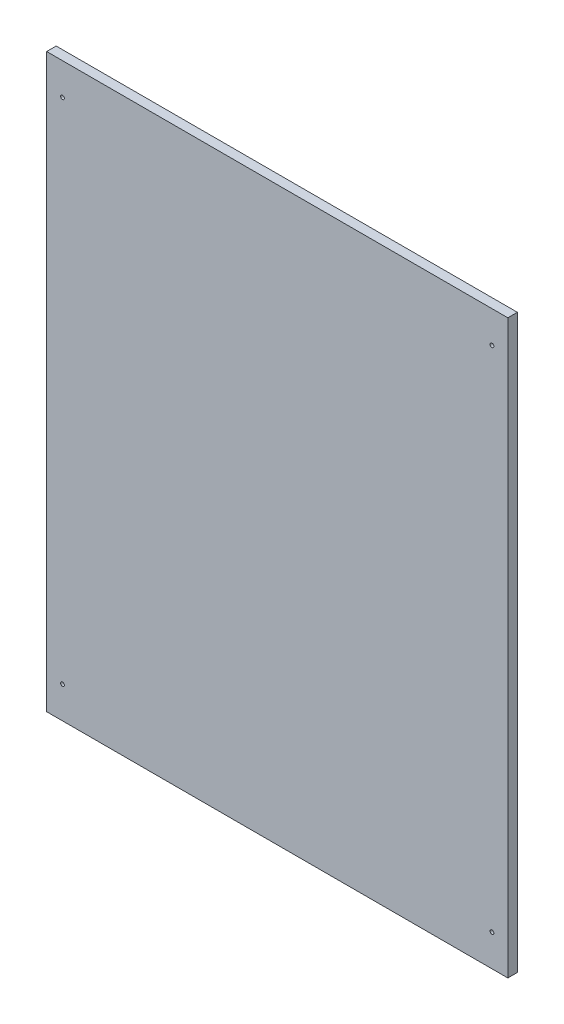
ISO-10303-21;
HEADER;
FILE_DESCRIPTION(('STEP AP214'),'2;1');
FILE_NAME('part.step','',(''),(''),'','','');
FILE_SCHEMA(('AUTOMOTIVE_DESIGN { 1 0 10303 214 1 1 1 1 }'));
ENDSEC;
DATA;
#1=APPLICATION_CONTEXT('core data for automotive mechanical design processes');
#2=APPLICATION_PROTOCOL_DEFINITION('international standard','automotive_design',2000,#1);
#3=PRODUCT_CONTEXT('',#1,'mechanical');
#4=PRODUCT('Part','Part','',(#3));
#5=PRODUCT_RELATED_PRODUCT_CATEGORY('part','',(#4));
#6=PRODUCT_DEFINITION_FORMATION('','',#4);
#7=PRODUCT_DEFINITION_CONTEXT('part definition',#1,'design');
#8=PRODUCT_DEFINITION('design','',#6,#7);
#9=PRODUCT_DEFINITION_SHAPE('','',#8);
#10=(LENGTH_UNIT() NAMED_UNIT(*) SI_UNIT(.MILLI.,.METRE.));
#11=(NAMED_UNIT(*) PLANE_ANGLE_UNIT() SI_UNIT($,.RADIAN.));
#12=(NAMED_UNIT(*) SI_UNIT($,.STERADIAN.) SOLID_ANGLE_UNIT());
#13=UNCERTAINTY_MEASURE_WITH_UNIT(LENGTH_MEASURE(1.E-05),#10,'distance_accuracy_value','');
#14=(GEOMETRIC_REPRESENTATION_CONTEXT(3) GLOBAL_UNCERTAINTY_ASSIGNED_CONTEXT((#13)) GLOBAL_UNIT_ASSIGNED_CONTEXT((#10,
#11,#12)) REPRESENTATION_CONTEXT('',''));
#15=CARTESIAN_POINT('',(0.,0.,0.));
#16=DIRECTION('',(0.,0.,1.));
#17=DIRECTION('',(1.,0.,0.));
#18=AXIS2_PLACEMENT_3D('',#15,#16,#17);
#19=CARTESIAN_POINT('',(-10.,0.,15.));
#20=DIRECTION('',(-1.,0.,0.));
#21=DIRECTION('',(0.,0.,1.));
#22=AXIS2_PLACEMENT_3D('',#19,#20,#21);
#23=PLANE('',#22);
#24=DIRECTION('',(0.,1.,0.));
#25=VECTOR('',#24,1.);
#26=CARTESIAN_POINT('',(-10.,0.,0.));
#27=LINE('',#26,#25);
#28=CARTESIAN_POINT('',(-10.,-874.999999999979,0.));
#29=VERTEX_POINT('',#28);
#30=CARTESIAN_POINT('',(-10.,24.9999999999994,0.));
#31=VERTEX_POINT('',#30);
#32=EDGE_CURVE('E118',#29,#31,#27,.T.);
#33=ORIENTED_EDGE('',*,*,#32,.F.);
#34=DIRECTION('',(0.,0.,-1.));
#35=VECTOR('',#34,1.);
#36=CARTESIAN_POINT('',(-10.,-874.999999999979,15.));
#37=LINE('',#36,#35);
#38=CARTESIAN_POINT('',(-10.,-874.999999999979,15.));
#39=VERTEX_POINT('',#38);
#40=EDGE_CURVE('E11',#39,#29,#37,.T.);
#41=ORIENTED_EDGE('',*,*,#40,.F.);
#42=DIRECTION('',(0.,1.,0.));
#43=VECTOR('',#42,1.);
#44=CARTESIAN_POINT('',(-10.,0.,15.));
#45=LINE('',#44,#43);
#46=CARTESIAN_POINT('',(-10.,24.9999999999994,15.));
#47=VERTEX_POINT('',#46);
#48=EDGE_CURVE('E99',#39,#47,#45,.T.);
#49=ORIENTED_EDGE('',*,*,#48,.T.);
#50=DIRECTION('',(0.,0.,-1.));
#51=VECTOR('',#50,1.);
#52=CARTESIAN_POINT('',(-10.,24.9999999999994,15.));
#53=LINE('',#52,#51);
#54=EDGE_CURVE('E80',#47,#31,#53,.T.);
#55=ORIENTED_EDGE('',*,*,#54,.T.);
#56=EDGE_LOOP('',(#33,#41,#49,#55));
#57=FACE_BOUND('',#56,.T.);
#58=ADVANCED_FACE('F41',(#57),#23,.T.);
#59=CARTESIAN_POINT('',(1.33807871425199E-13,-874.999999999979,15.));
#60=DIRECTION('',(0.,-1.,0.));
#61=DIRECTION('',(1.,0.,0.));
#62=AXIS2_PLACEMENT_3D('',#59,#60,#61);
#63=PLANE('',#62);
#64=DIRECTION('',(-1.,0.,0.));
#65=VECTOR('',#64,1.);
#66=CARTESIAN_POINT('',(1.33807871425199E-13,-874.999999999979,0.));
#67=LINE('',#66,#65);
#68=CARTESIAN_POINT('',(716.00000000003,-874.999999999978,0.));
#69=VERTEX_POINT('',#68);
#70=EDGE_CURVE('E91',#69,#29,#67,.T.);
#71=ORIENTED_EDGE('',*,*,#70,.F.);
#72=DIRECTION('',(0.,0.,-1.));
#73=VECTOR('',#72,1.);
#74=CARTESIAN_POINT('',(716.00000000003,-874.999999999978,15.));
#75=LINE('',#74,#73);
#76=CARTESIAN_POINT('',(716.00000000003,-874.999999999978,15.));
#77=VERTEX_POINT('',#76);
#78=EDGE_CURVE('E50',#77,#69,#75,.T.);
#79=ORIENTED_EDGE('',*,*,#78,.F.);
#80=DIRECTION('',(-1.,0.,0.));
#81=VECTOR('',#80,1.);
#82=CARTESIAN_POINT('',(1.33807871425199E-13,-874.999999999979,15.));
#83=LINE('',#82,#81);
#84=EDGE_CURVE('E89',#77,#39,#83,.T.);
#85=ORIENTED_EDGE('',*,*,#84,.T.);
#86=ORIENTED_EDGE('',*,*,#40,.T.);
#87=EDGE_LOOP('',(#71,#79,#85,#86));
#88=FACE_BOUND('',#87,.T.);
#89=ADVANCED_FACE('F88',(#88),#63,.T.);
#90=CARTESIAN_POINT('',(716.00000000003,0.,15.));
#91=DIRECTION('',(1.,0.,0.));
#92=DIRECTION('',(0.,0.,-1.));
#93=AXIS2_PLACEMENT_3D('',#90,#91,#92);
#94=PLANE('',#93);
#95=DIRECTION('',(0.,-1.,0.));
#96=VECTOR('',#95,1.);
#97=CARTESIAN_POINT('',(716.00000000003,0.,0.));
#98=LINE('',#97,#96);
#99=CARTESIAN_POINT('',(716.00000000003,24.9999999999994,0.));
#100=VERTEX_POINT('',#99);
#101=EDGE_CURVE('E122',#100,#69,#98,.T.);
#102=ORIENTED_EDGE('',*,*,#101,.F.);
#103=DIRECTION('',(0.,0.,-1.));
#104=VECTOR('',#103,1.);
#105=CARTESIAN_POINT('',(716.00000000003,24.9999999999994,15.));
#106=LINE('',#105,#104);
#107=CARTESIAN_POINT('',(716.00000000003,24.9999999999994,15.));
#108=VERTEX_POINT('',#107);
#109=EDGE_CURVE('E73',#108,#100,#106,.T.);
#110=ORIENTED_EDGE('',*,*,#109,.F.);
#111=DIRECTION('',(0.,-1.,0.));
#112=VECTOR('',#111,1.);
#113=CARTESIAN_POINT('',(716.00000000003,0.,15.));
#114=LINE('',#113,#112);
#115=EDGE_CURVE('E98',#108,#77,#114,.T.);
#116=ORIENTED_EDGE('',*,*,#115,.T.);
#117=ORIENTED_EDGE('',*,*,#78,.T.);
#118=EDGE_LOOP('',(#102,#110,#116,#117));
#119=FACE_BOUND('',#118,.T.);
#120=ADVANCED_FACE('F101',(#119),#94,.T.);
#121=CARTESIAN_POINT('',(691.00000000003,-824.999999999959,15.));
#122=DIRECTION('',(0.,0.,-1.));
#123=DIRECTION('',(-1.,0.,0.));
#124=AXIS2_PLACEMENT_3D('',#121,#122,#123);
#125=CYLINDRICAL_SURFACE('',#124,3.00000000000005);
#126=CARTESIAN_POINT('',(691.00000000003,-824.999999999959,15.));
#127=DIRECTION('',(0.,0.,1.));
#128=DIRECTION('',(1.,0.,0.));
#129=AXIS2_PLACEMENT_3D('',#126,#127,#128);
#130=CIRCLE('',#129,3.00000000000005);
#131=CARTESIAN_POINT('',(694.00000000003,-824.999999999959,15.));
#132=VERTEX_POINT('',#131);
#133=EDGE_CURVE('E103',#132,#132,#130,.T.);
#134=ORIENTED_EDGE('',*,*,#133,.T.);
#135=EDGE_LOOP('',(#134));
#136=FACE_BOUND('',#135,.T.);
#137=CARTESIAN_POINT('',(691.00000000003,-824.999999999959,0.));
#138=DIRECTION('',(0.,0.,1.));
#139=DIRECTION('',(1.,0.,0.));
#140=AXIS2_PLACEMENT_3D('',#137,#138,#139);
#141=CIRCLE('',#140,3.00000000000005);
#142=CARTESIAN_POINT('',(694.00000000003,-824.999999999959,0.));
#143=VERTEX_POINT('',#142);
#144=EDGE_CURVE('E126',#143,#143,#141,.T.);
#145=ORIENTED_EDGE('',*,*,#144,.F.);
#146=EDGE_LOOP('',(#145));
#147=FACE_BOUND('',#146,.T.);
#148=ADVANCED_FACE('F160',(#136,#147),#125,.F.);
#149=CARTESIAN_POINT('',(0.,24.9999999999994,15.));
#150=DIRECTION('',(0.,-1.,0.));
#151=DIRECTION('',(0.,0.,-1.));
#152=AXIS2_PLACEMENT_3D('',#149,#150,#151);
#153=PLANE('',#152);
#154=DIRECTION('',(-1.,0.,0.));
#155=VECTOR('',#154,1.);
#156=CARTESIAN_POINT('',(0.,24.9999999999994,0.));
#157=LINE('',#156,#155);
#158=EDGE_CURVE('E124',#100,#31,#157,.T.);
#159=ORIENTED_EDGE('',*,*,#158,.T.);
#160=ORIENTED_EDGE('',*,*,#54,.F.);
#161=DIRECTION('',(-1.,0.,0.));
#162=VECTOR('',#161,1.);
#163=CARTESIAN_POINT('',(0.,24.9999999999994,15.));
#164=LINE('',#163,#162);
#165=EDGE_CURVE('E58',#108,#47,#164,.T.);
#166=ORIENTED_EDGE('',*,*,#165,.F.);
#167=ORIENTED_EDGE('',*,*,#109,.T.);
#168=EDGE_LOOP('',(#159,#160,#166,#167));
#169=FACE_BOUND('',#168,.T.);
#170=ADVANCED_FACE('F152',(#169),#153,.F.);
#171=CARTESIAN_POINT('',(15.,-25.0000000000006,15.));
#172=DIRECTION('',(0.,0.,-1.));
#173=DIRECTION('',(-1.,0.,0.));
#174=AXIS2_PLACEMENT_3D('',#171,#172,#173);
#175=CYLINDRICAL_SURFACE('',#174,3.);
#176=CARTESIAN_POINT('',(15.,-25.0000000000006,15.));
#177=DIRECTION('',(0.,0.,1.));
#178=DIRECTION('',(1.,0.,0.));
#179=AXIS2_PLACEMENT_3D('',#176,#177,#178);
#180=CIRCLE('',#179,3.);
#181=CARTESIAN_POINT('',(18.,-25.0000000000006,15.));
#182=VERTEX_POINT('',#181);
#183=EDGE_CURVE('E137',#182,#182,#180,.T.);
#184=ORIENTED_EDGE('',*,*,#183,.T.);
#185=EDGE_LOOP('',(#184));
#186=FACE_BOUND('',#185,.T.);
#187=CARTESIAN_POINT('',(15.,-25.0000000000006,0.));
#188=DIRECTION('',(0.,0.,1.));
#189=DIRECTION('',(1.,0.,0.));
#190=AXIS2_PLACEMENT_3D('',#187,#188,#189);
#191=CIRCLE('',#190,3.);
#192=CARTESIAN_POINT('',(18.,-25.0000000000006,0.));
#193=VERTEX_POINT('',#192);
#194=EDGE_CURVE('E115',#193,#193,#191,.T.);
#195=ORIENTED_EDGE('',*,*,#194,.F.);
#196=EDGE_LOOP('',(#195));
#197=FACE_BOUND('',#196,.T.);
#198=ADVANCED_FACE('F150',(#186,#197),#175,.F.);
#199=CARTESIAN_POINT('',(691.00000000003,-25.0000000000005,15.));
#200=DIRECTION('',(0.,0.,-1.));
#201=DIRECTION('',(-1.,0.,0.));
#202=AXIS2_PLACEMENT_3D('',#199,#200,#201);
#203=CYLINDRICAL_SURFACE('',#202,2.99999999999993);
#204=CARTESIAN_POINT('',(691.00000000003,-25.0000000000005,15.));
#205=DIRECTION('',(0.,0.,1.));
#206=DIRECTION('',(1.,0.,0.));
#207=AXIS2_PLACEMENT_3D('',#204,#205,#206);
#208=CIRCLE('',#207,2.99999999999993);
#209=CARTESIAN_POINT('',(694.00000000003,-25.0000000000005,15.));
#210=VERTEX_POINT('',#209);
#211=EDGE_CURVE('E132',#210,#210,#208,.F.);
#212=ORIENTED_EDGE('',*,*,#211,.F.);
#213=EDGE_LOOP('',(#212));
#214=FACE_BOUND('',#213,.T.);
#215=CARTESIAN_POINT('',(691.00000000003,-25.0000000000005,0.));
#216=DIRECTION('',(0.,0.,1.));
#217=DIRECTION('',(1.,0.,0.));
#218=AXIS2_PLACEMENT_3D('',#215,#216,#217);
#219=CIRCLE('',#218,2.99999999999993);
#220=CARTESIAN_POINT('',(694.00000000003,-25.0000000000005,0.));
#221=VERTEX_POINT('',#220);
#222=EDGE_CURVE('E112',#221,#221,#219,.F.);
#223=ORIENTED_EDGE('',*,*,#222,.T.);
#224=EDGE_LOOP('',(#223));
#225=FACE_BOUND('',#224,.T.);
#226=ADVANCED_FACE('F43',(#214,#225),#203,.F.);
#227=CARTESIAN_POINT('',(15.,-824.999999999959,15.));
#228=DIRECTION('',(0.,0.,-1.));
#229=DIRECTION('',(-1.,0.,0.));
#230=AXIS2_PLACEMENT_3D('',#227,#228,#229);
#231=CYLINDRICAL_SURFACE('',#230,3.);
#232=CARTESIAN_POINT('',(15.,-824.999999999959,15.));
#233=DIRECTION('',(0.,0.,1.));
#234=DIRECTION('',(1.,0.,0.));
#235=AXIS2_PLACEMENT_3D('',#232,#233,#234);
#236=CIRCLE('',#235,3.);
#237=CARTESIAN_POINT('',(18.,-824.999999999959,15.));
#238=VERTEX_POINT('',#237);
#239=EDGE_CURVE('E109',#238,#238,#236,.F.);
#240=ORIENTED_EDGE('',*,*,#239,.F.);
#241=EDGE_LOOP('',(#240));
#242=FACE_BOUND('',#241,.T.);
#243=CARTESIAN_POINT('',(15.,-824.999999999959,0.));
#244=DIRECTION('',(0.,0.,1.));
#245=DIRECTION('',(1.,0.,0.));
#246=AXIS2_PLACEMENT_3D('',#243,#244,#245);
#247=CIRCLE('',#246,3.);
#248=CARTESIAN_POINT('',(18.,-824.999999999959,0.));
#249=VERTEX_POINT('',#248);
#250=EDGE_CURVE('E129',#249,#249,#247,.F.);
#251=ORIENTED_EDGE('',*,*,#250,.T.);
#252=EDGE_LOOP('',(#251));
#253=FACE_BOUND('',#252,.T.);
#254=ADVANCED_FACE('F158',(#242,#253),#231,.F.);
#255=CARTESIAN_POINT('',(0.,0.,15.));
#256=DIRECTION('',(0.,0.,1.));
#257=DIRECTION('',(1.,0.,0.));
#258=AXIS2_PLACEMENT_3D('',#255,#256,#257);
#259=PLANE('',#258);
#260=ORIENTED_EDGE('',*,*,#211,.T.);
#261=EDGE_LOOP('',(#260));
#262=FACE_BOUND('',#261,.T.);
#263=ORIENTED_EDGE('',*,*,#183,.F.);
#264=EDGE_LOOP('',(#263));
#265=FACE_BOUND('',#264,.T.);
#266=ORIENTED_EDGE('',*,*,#48,.F.);
#267=ORIENTED_EDGE('',*,*,#84,.F.);
#268=ORIENTED_EDGE('',*,*,#115,.F.);
#269=ORIENTED_EDGE('',*,*,#165,.T.);
#270=EDGE_LOOP('',(#266,#267,#268,#269));
#271=FACE_BOUND('',#270,.T.);
#272=ORIENTED_EDGE('',*,*,#133,.F.);
#273=EDGE_LOOP('',(#272));
#274=FACE_BOUND('',#273,.T.);
#275=ORIENTED_EDGE('',*,*,#239,.T.);
#276=EDGE_LOOP('',(#275));
#277=FACE_BOUND('',#276,.T.);
#278=ADVANCED_FACE('F96',(#262,#265,#271,#274,#277),#259,.T.);
#279=CARTESIAN_POINT('',(0.,0.,0.));
#280=DIRECTION('',(0.,0.,1.));
#281=DIRECTION('',(1.,0.,0.));
#282=AXIS2_PLACEMENT_3D('',#279,#280,#281);
#283=PLANE('',#282);
#284=ORIENTED_EDGE('',*,*,#222,.F.);
#285=EDGE_LOOP('',(#284));
#286=FACE_BOUND('',#285,.T.);
#287=ORIENTED_EDGE('',*,*,#194,.T.);
#288=EDGE_LOOP('',(#287));
#289=FACE_BOUND('',#288,.T.);
#290=ORIENTED_EDGE('',*,*,#32,.T.);
#291=ORIENTED_EDGE('',*,*,#158,.F.);
#292=ORIENTED_EDGE('',*,*,#101,.T.);
#293=ORIENTED_EDGE('',*,*,#70,.T.);
#294=EDGE_LOOP('',(#290,#291,#292,#293));
#295=FACE_BOUND('',#294,.T.);
#296=ORIENTED_EDGE('',*,*,#144,.T.);
#297=EDGE_LOOP('',(#296));
#298=FACE_BOUND('',#297,.T.);
#299=ORIENTED_EDGE('',*,*,#250,.F.);
#300=EDGE_LOOP('',(#299));
#301=FACE_BOUND('',#300,.T.);
#302=ADVANCED_FACE('F166',(#286,#289,#295,#298,#301),#283,.F.);
#303=CLOSED_SHELL('',(#58,#89,#120,#148,#170,#198,#226,#254,#278,#302));
#304=MANIFOLD_SOLID_BREP('B2',#303);
#305=ADVANCED_BREP_SHAPE_REPRESENTATION('',(#18,#304),#14);
#306=SHAPE_DEFINITION_REPRESENTATION(#9,#305);
ENDSEC;
END-ISO-10303-21;
